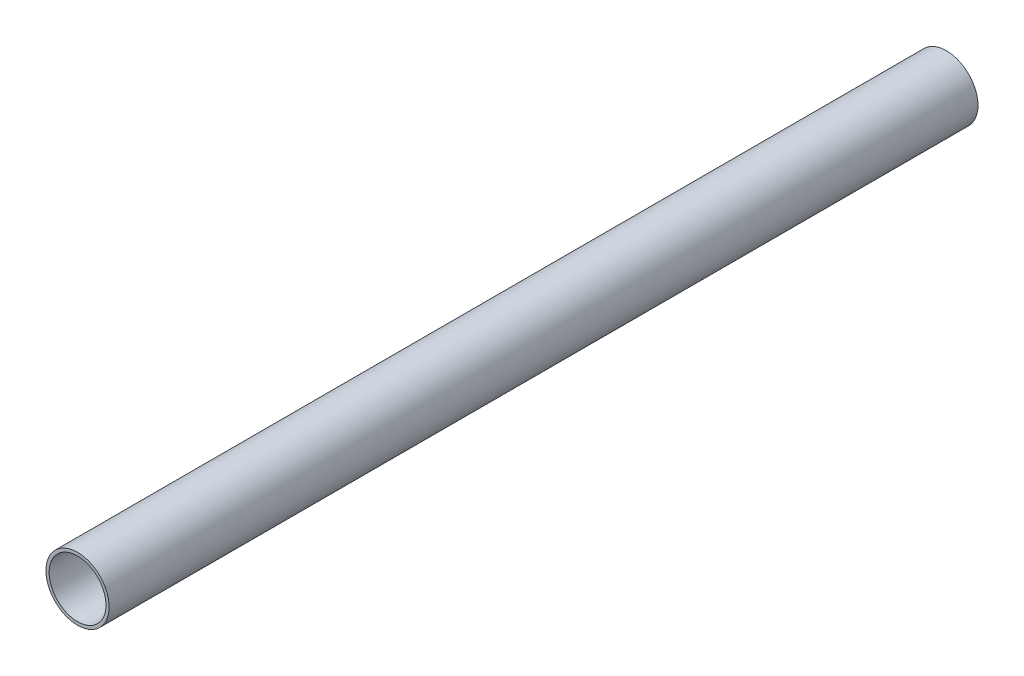
ISO-10303-21;
HEADER;
FILE_DESCRIPTION(('STEP AP214'),'2;1');
FILE_NAME('part.step','',(''),(''),'','','');
FILE_SCHEMA(('AUTOMOTIVE_DESIGN { 1 0 10303 214 1 1 1 1 }'));
ENDSEC;
DATA;
#1=APPLICATION_CONTEXT('core data for automotive mechanical design processes');
#2=APPLICATION_PROTOCOL_DEFINITION('international standard','automotive_design',2000,#1);
#3=PRODUCT_CONTEXT('',#1,'mechanical');
#4=PRODUCT('Part','Part','',(#3));
#5=PRODUCT_RELATED_PRODUCT_CATEGORY('part','',(#4));
#6=PRODUCT_DEFINITION_FORMATION('','',#4);
#7=PRODUCT_DEFINITION_CONTEXT('part definition',#1,'design');
#8=PRODUCT_DEFINITION('design','',#6,#7);
#9=PRODUCT_DEFINITION_SHAPE('','',#8);
#10=(LENGTH_UNIT() NAMED_UNIT(*) SI_UNIT(.MILLI.,.METRE.));
#11=(NAMED_UNIT(*) PLANE_ANGLE_UNIT() SI_UNIT($,.RADIAN.));
#12=(NAMED_UNIT(*) SI_UNIT($,.STERADIAN.) SOLID_ANGLE_UNIT());
#13=UNCERTAINTY_MEASURE_WITH_UNIT(LENGTH_MEASURE(1.E-05),#10,'distance_accuracy_value','');
#14=(GEOMETRIC_REPRESENTATION_CONTEXT(3) GLOBAL_UNCERTAINTY_ASSIGNED_CONTEXT((#13)) GLOBAL_UNIT_ASSIGNED_CONTEXT((#10,
#11,#12)) REPRESENTATION_CONTEXT('',''));
#15=CARTESIAN_POINT('',(0.,0.,0.));
#16=DIRECTION('',(0.,0.,1.));
#17=DIRECTION('',(1.,0.,0.));
#18=AXIS2_PLACEMENT_3D('',#15,#16,#17);
#19=CARTESIAN_POINT('',(0.,0.,110.));
#20=DIRECTION('',(0.,0.,1.));
#21=DIRECTION('',(1.,0.,0.));
#22=AXIS2_PLACEMENT_3D('',#19,#20,#21);
#23=PLANE('',#22);
#24=CARTESIAN_POINT('',(0.,0.,110.));
#25=DIRECTION('',(0.,0.,1.));
#26=DIRECTION('',(1.,0.,0.));
#27=AXIS2_PLACEMENT_3D('',#24,#25,#26);
#28=CIRCLE('',#27,8.);
#29=CARTESIAN_POINT('',(8.,0.,110.));
#30=VERTEX_POINT('',#29);
#31=EDGE_CURVE('E9',#30,#30,#28,.T.);
#32=ORIENTED_EDGE('',*,*,#31,.T.);
#33=EDGE_LOOP('',(#32));
#34=FACE_BOUND('',#33,.T.);
#35=CARTESIAN_POINT('',(0.,0.,110.));
#36=DIRECTION('',(0.,0.,1.));
#37=DIRECTION('',(1.,0.,0.));
#38=AXIS2_PLACEMENT_3D('',#35,#36,#37);
#39=CIRCLE('',#38,7.2);
#40=CARTESIAN_POINT('',(7.2,0.,110.));
#41=VERTEX_POINT('',#40);
#42=EDGE_CURVE('E34',#41,#41,#39,.T.);
#43=ORIENTED_EDGE('',*,*,#42,.F.);
#44=EDGE_LOOP('',(#43));
#45=FACE_BOUND('',#44,.T.);
#46=ADVANCED_FACE('F14',(#34,#45),#23,.T.);
#47=CARTESIAN_POINT('',(0.,0.,-110.));
#48=DIRECTION('',(0.,0.,1.));
#49=DIRECTION('',(1.,0.,0.));
#50=AXIS2_PLACEMENT_3D('',#47,#48,#49);
#51=PLANE('',#50);
#52=CARTESIAN_POINT('',(0.,0.,-110.));
#53=DIRECTION('',(0.,0.,1.));
#54=DIRECTION('',(1.,0.,0.));
#55=AXIS2_PLACEMENT_3D('',#52,#53,#54);
#56=CIRCLE('',#55,8.);
#57=CARTESIAN_POINT('',(8.,0.,-110.));
#58=VERTEX_POINT('',#57);
#59=EDGE_CURVE('E18',#58,#58,#56,.T.);
#60=ORIENTED_EDGE('',*,*,#59,.F.);
#61=EDGE_LOOP('',(#60));
#62=FACE_BOUND('',#61,.T.);
#63=CARTESIAN_POINT('',(0.,0.,-110.));
#64=DIRECTION('',(0.,0.,1.));
#65=DIRECTION('',(1.,0.,0.));
#66=AXIS2_PLACEMENT_3D('',#63,#64,#65);
#67=CIRCLE('',#66,7.2);
#68=CARTESIAN_POINT('',(7.2,0.,-110.));
#69=VERTEX_POINT('',#68);
#70=EDGE_CURVE('E29',#69,#69,#67,.T.);
#71=ORIENTED_EDGE('',*,*,#70,.T.);
#72=EDGE_LOOP('',(#71));
#73=FACE_BOUND('',#72,.T.);
#74=ADVANCED_FACE('F47',(#62,#73),#51,.F.);
#75=CARTESIAN_POINT('',(0.,0.,110.));
#76=DIRECTION('',(0.,0.,-1.));
#77=DIRECTION('',(-1.,0.,0.));
#78=AXIS2_PLACEMENT_3D('',#75,#76,#77);
#79=CYLINDRICAL_SURFACE('',#78,8.);
#80=ORIENTED_EDGE('',*,*,#31,.F.);
#81=EDGE_LOOP('',(#80));
#82=FACE_BOUND('',#81,.T.);
#83=ORIENTED_EDGE('',*,*,#59,.T.);
#84=EDGE_LOOP('',(#83));
#85=FACE_BOUND('',#84,.T.);
#86=ADVANCED_FACE('F16',(#82,#85),#79,.T.);
#87=CARTESIAN_POINT('',(0.,0.,110.));
#88=DIRECTION('',(0.,0.,-1.));
#89=DIRECTION('',(-1.,0.,0.));
#90=AXIS2_PLACEMENT_3D('',#87,#88,#89);
#91=CYLINDRICAL_SURFACE('',#90,7.2);
#92=ORIENTED_EDGE('',*,*,#42,.T.);
#93=EDGE_LOOP('',(#92));
#94=FACE_BOUND('',#93,.T.);
#95=ORIENTED_EDGE('',*,*,#70,.F.);
#96=EDGE_LOOP('',(#95));
#97=FACE_BOUND('',#96,.T.);
#98=ADVANCED_FACE('F43',(#94,#97),#91,.F.);
#99=CLOSED_SHELL('',(#46,#74,#86,#98));
#100=MANIFOLD_SOLID_BREP('B1',#99);
#101=ADVANCED_BREP_SHAPE_REPRESENTATION('',(#18,#100),#14);
#102=SHAPE_DEFINITION_REPRESENTATION(#9,#101);
ENDSEC;
END-ISO-10303-21;
